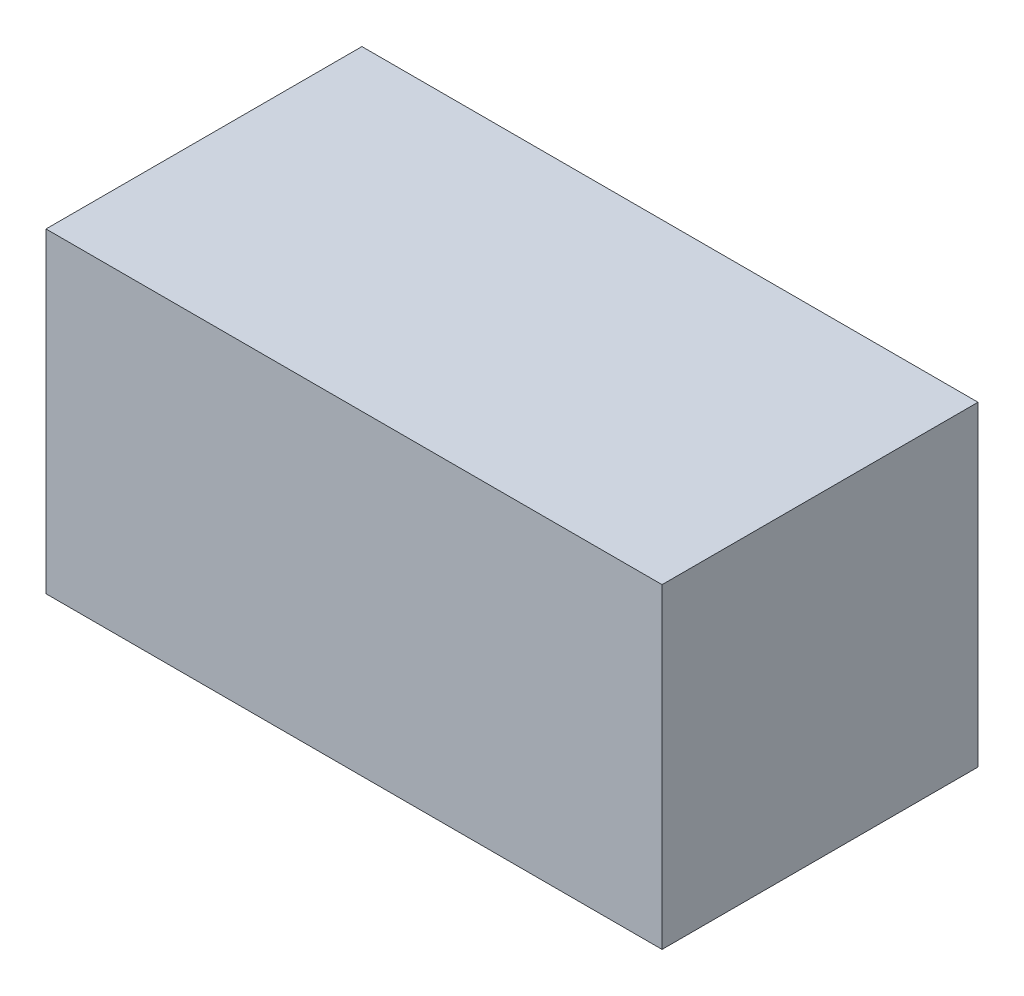
ISO-10303-21;
HEADER;
FILE_DESCRIPTION(('STEP AP214'),'2;1');
FILE_NAME('part.step','',(''),(''),'','','');
FILE_SCHEMA(('AUTOMOTIVE_DESIGN { 1 0 10303 214 1 1 1 1 }'));
ENDSEC;
DATA;
#1=APPLICATION_CONTEXT('core data for automotive mechanical design processes');
#2=APPLICATION_PROTOCOL_DEFINITION('international standard','automotive_design',2000,#1);
#3=PRODUCT_CONTEXT('',#1,'mechanical');
#4=PRODUCT('Part','Part','',(#3));
#5=PRODUCT_RELATED_PRODUCT_CATEGORY('part','',(#4));
#6=PRODUCT_DEFINITION_FORMATION('','',#4);
#7=PRODUCT_DEFINITION_CONTEXT('part definition',#1,'design');
#8=PRODUCT_DEFINITION('design','',#6,#7);
#9=PRODUCT_DEFINITION_SHAPE('','',#8);
#10=(LENGTH_UNIT() NAMED_UNIT(*) SI_UNIT(.MILLI.,.METRE.));
#11=(NAMED_UNIT(*) PLANE_ANGLE_UNIT() SI_UNIT($,.RADIAN.));
#12=(NAMED_UNIT(*) SI_UNIT($,.STERADIAN.) SOLID_ANGLE_UNIT());
#13=UNCERTAINTY_MEASURE_WITH_UNIT(LENGTH_MEASURE(1.E-05),#10,'distance_accuracy_value','');
#14=(GEOMETRIC_REPRESENTATION_CONTEXT(3) GLOBAL_UNCERTAINTY_ASSIGNED_CONTEXT((#13)) GLOBAL_UNIT_ASSIGNED_CONTEXT((#10,
#11,#12)) REPRESENTATION_CONTEXT('',''));
#15=CARTESIAN_POINT('',(0.,0.,0.));
#16=DIRECTION('',(0.,0.,1.));
#17=DIRECTION('',(1.,0.,0.));
#18=AXIS2_PLACEMENT_3D('',#15,#16,#17);
#19=CARTESIAN_POINT('',(487.5,500.,-250.));
#20=DIRECTION('',(-1.,0.,0.));
#21=DIRECTION('',(0.,0.,1.));
#22=AXIS2_PLACEMENT_3D('',#19,#20,#21);
#23=PLANE('',#22);
#24=DIRECTION('',(0.,0.,-1.));
#25=VECTOR('',#24,1.);
#26=CARTESIAN_POINT('',(487.5,0.,-250.));
#27=LINE('',#26,#25);
#28=CARTESIAN_POINT('',(487.5,0.,250.));
#29=VERTEX_POINT('',#28);
#30=CARTESIAN_POINT('',(487.5,0.,-250.));
#31=VERTEX_POINT('',#30);
#32=EDGE_CURVE('E95',#29,#31,#27,.T.);
#33=ORIENTED_EDGE('',*,*,#32,.T.);
#34=DIRECTION('',(0.,-1.,0.));
#35=VECTOR('',#34,1.);
#36=CARTESIAN_POINT('',(487.5,500.,-250.));
#37=LINE('',#36,#35);
#38=CARTESIAN_POINT('',(487.5,500.,-250.));
#39=VERTEX_POINT('',#38);
#40=EDGE_CURVE('E11',#39,#31,#37,.T.);
#41=ORIENTED_EDGE('',*,*,#40,.F.);
#42=DIRECTION('',(0.,0.,-1.));
#43=VECTOR('',#42,1.);
#44=CARTESIAN_POINT('',(487.5,500.,-250.));
#45=LINE('',#44,#43);
#46=CARTESIAN_POINT('',(487.5,500.,250.));
#47=VERTEX_POINT('',#46);
#48=EDGE_CURVE('E83',#47,#39,#45,.T.);
#49=ORIENTED_EDGE('',*,*,#48,.F.);
#50=DIRECTION('',(0.,-1.,0.));
#51=VECTOR('',#50,1.);
#52=CARTESIAN_POINT('',(487.5,500.,250.));
#53=LINE('',#52,#51);
#54=EDGE_CURVE('E91',#47,#29,#53,.T.);
#55=ORIENTED_EDGE('',*,*,#54,.T.);
#56=EDGE_LOOP('',(#33,#41,#49,#55));
#57=FACE_BOUND('',#56,.T.);
#58=ADVANCED_FACE('F32',(#57),#23,.F.);
#59=CARTESIAN_POINT('',(-487.5,500.,-250.));
#60=DIRECTION('',(0.,0.,1.));
#61=DIRECTION('',(1.,0.,0.));
#62=AXIS2_PLACEMENT_3D('',#59,#60,#61);
#63=PLANE('',#62);
#64=DIRECTION('',(-1.,0.,0.));
#65=VECTOR('',#64,1.);
#66=CARTESIAN_POINT('',(-487.5,0.,-250.));
#67=LINE('',#66,#65);
#68=CARTESIAN_POINT('',(-487.5,0.,-250.));
#69=VERTEX_POINT('',#68);
#70=EDGE_CURVE('E87',#31,#69,#67,.T.);
#71=ORIENTED_EDGE('',*,*,#70,.T.);
#72=DIRECTION('',(0.,-1.,0.));
#73=VECTOR('',#72,1.);
#74=CARTESIAN_POINT('',(-487.5,500.,-250.));
#75=LINE('',#74,#73);
#76=CARTESIAN_POINT('',(-487.5,500.,-250.));
#77=VERTEX_POINT('',#76);
#78=EDGE_CURVE('E40',#77,#69,#75,.T.);
#79=ORIENTED_EDGE('',*,*,#78,.F.);
#80=DIRECTION('',(-1.,0.,0.));
#81=VECTOR('',#80,1.);
#82=CARTESIAN_POINT('',(-487.5,500.,-250.));
#83=LINE('',#82,#81);
#84=EDGE_CURVE('E78',#39,#77,#83,.T.);
#85=ORIENTED_EDGE('',*,*,#84,.F.);
#86=ORIENTED_EDGE('',*,*,#40,.T.);
#87=EDGE_LOOP('',(#71,#79,#85,#86));
#88=FACE_BOUND('',#87,.T.);
#89=ADVANCED_FACE('F86',(#88),#63,.F.);
#90=CARTESIAN_POINT('',(-487.5,500.,-250.));
#91=DIRECTION('',(1.,0.,0.));
#92=DIRECTION('',(0.,0.,-1.));
#93=AXIS2_PLACEMENT_3D('',#90,#91,#92);
#94=PLANE('',#93);
#95=DIRECTION('',(0.,0.,1.));
#96=VECTOR('',#95,1.);
#97=CARTESIAN_POINT('',(-487.5,0.,-250.));
#98=LINE('',#97,#96);
#99=CARTESIAN_POINT('',(-487.5,0.,250.));
#100=VERTEX_POINT('',#99);
#101=EDGE_CURVE('E65',#69,#100,#98,.T.);
#102=ORIENTED_EDGE('',*,*,#101,.T.);
#103=DIRECTION('',(0.,-1.,0.));
#104=VECTOR('',#103,1.);
#105=CARTESIAN_POINT('',(-487.5,500.,250.));
#106=LINE('',#105,#104);
#107=CARTESIAN_POINT('',(-487.5,500.,250.));
#108=VERTEX_POINT('',#107);
#109=EDGE_CURVE('E88',#108,#100,#106,.T.);
#110=ORIENTED_EDGE('',*,*,#109,.F.);
#111=DIRECTION('',(0.,0.,1.));
#112=VECTOR('',#111,1.);
#113=CARTESIAN_POINT('',(-487.5,500.,-250.));
#114=LINE('',#113,#112);
#115=EDGE_CURVE('E81',#77,#108,#114,.T.);
#116=ORIENTED_EDGE('',*,*,#115,.F.);
#117=ORIENTED_EDGE('',*,*,#78,.T.);
#118=EDGE_LOOP('',(#102,#110,#116,#117));
#119=FACE_BOUND('',#118,.T.);
#120=ADVANCED_FACE('F89',(#119),#94,.F.);
#121=CARTESIAN_POINT('',(-487.5,500.,250.));
#122=DIRECTION('',(0.,0.,-1.));
#123=DIRECTION('',(-1.,0.,0.));
#124=AXIS2_PLACEMENT_3D('',#121,#122,#123);
#125=PLANE('',#124);
#126=DIRECTION('',(1.,0.,0.));
#127=VECTOR('',#126,1.);
#128=CARTESIAN_POINT('',(-487.5,0.,250.));
#129=LINE('',#128,#127);
#130=EDGE_CURVE('E71',#100,#29,#129,.T.);
#131=ORIENTED_EDGE('',*,*,#130,.T.);
#132=ORIENTED_EDGE('',*,*,#54,.F.);
#133=DIRECTION('',(1.,0.,0.));
#134=VECTOR('',#133,1.);
#135=CARTESIAN_POINT('',(-487.5,500.,250.));
#136=LINE('',#135,#134);
#137=EDGE_CURVE('E48',#108,#47,#136,.T.);
#138=ORIENTED_EDGE('',*,*,#137,.F.);
#139=ORIENTED_EDGE('',*,*,#109,.T.);
#140=EDGE_LOOP('',(#131,#132,#138,#139));
#141=FACE_BOUND('',#140,.T.);
#142=ADVANCED_FACE('F102',(#141),#125,.F.);
#143=CARTESIAN_POINT('',(0.,500.,0.));
#144=DIRECTION('',(0.,1.,0.));
#145=DIRECTION('',(0.,0.,1.));
#146=AXIS2_PLACEMENT_3D('',#143,#144,#145);
#147=PLANE('',#146);
#148=ORIENTED_EDGE('',*,*,#48,.T.);
#149=ORIENTED_EDGE('',*,*,#84,.T.);
#150=ORIENTED_EDGE('',*,*,#115,.T.);
#151=ORIENTED_EDGE('',*,*,#137,.T.);
#152=EDGE_LOOP('',(#148,#149,#150,#151));
#153=FACE_BOUND('',#152,.T.);
#154=ADVANCED_FACE('F79',(#153),#147,.T.);
#155=CARTESIAN_POINT('',(0.,0.,0.));
#156=DIRECTION('',(0.,1.,0.));
#157=DIRECTION('',(0.,0.,1.));
#158=AXIS2_PLACEMENT_3D('',#155,#156,#157);
#159=PLANE('',#158);
#160=ORIENTED_EDGE('',*,*,#32,.F.);
#161=ORIENTED_EDGE('',*,*,#130,.F.);
#162=ORIENTED_EDGE('',*,*,#101,.F.);
#163=ORIENTED_EDGE('',*,*,#70,.F.);
#164=EDGE_LOOP('',(#160,#161,#162,#163));
#165=FACE_BOUND('',#164,.T.);
#166=ADVANCED_FACE('F105',(#165),#159,.F.);
#167=CLOSED_SHELL('',(#58,#89,#120,#142,#154,#166));
#168=MANIFOLD_SOLID_BREP('B2',#167);
#169=ADVANCED_BREP_SHAPE_REPRESENTATION('',(#18,#168),#14);
#170=SHAPE_DEFINITION_REPRESENTATION(#9,#169);
ENDSEC;
END-ISO-10303-21;
